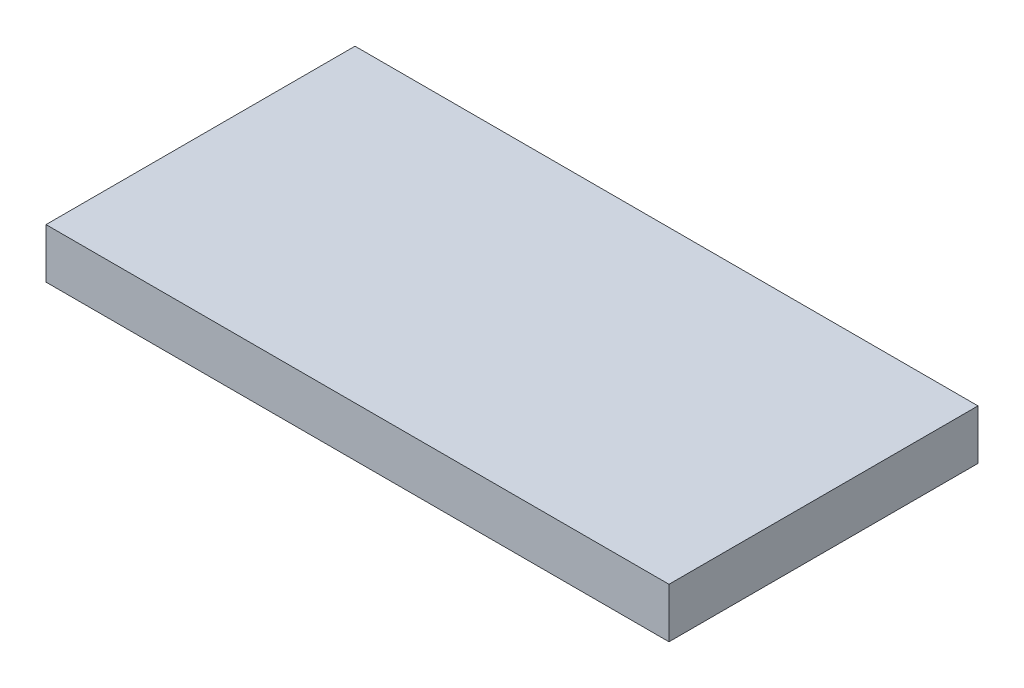
ISO-10303-21;
HEADER;
FILE_DESCRIPTION(('STEP AP214'),'2;1');
FILE_NAME('part.step','',(''),(''),'','','');
FILE_SCHEMA(('AUTOMOTIVE_DESIGN { 1 0 10303 214 1 1 1 1 }'));
ENDSEC;
DATA;
#1=APPLICATION_CONTEXT('core data for automotive mechanical design processes');
#2=APPLICATION_PROTOCOL_DEFINITION('international standard','automotive_design',2000,#1);
#3=PRODUCT_CONTEXT('',#1,'mechanical');
#4=PRODUCT('Part','Part','',(#3));
#5=PRODUCT_RELATED_PRODUCT_CATEGORY('part','',(#4));
#6=PRODUCT_DEFINITION_FORMATION('','',#4);
#7=PRODUCT_DEFINITION_CONTEXT('part definition',#1,'design');
#8=PRODUCT_DEFINITION('design','',#6,#7);
#9=PRODUCT_DEFINITION_SHAPE('','',#8);
#10=(LENGTH_UNIT() NAMED_UNIT(*) SI_UNIT(.MILLI.,.METRE.));
#11=(NAMED_UNIT(*) PLANE_ANGLE_UNIT() SI_UNIT($,.RADIAN.));
#12=(NAMED_UNIT(*) SI_UNIT($,.STERADIAN.) SOLID_ANGLE_UNIT());
#13=UNCERTAINTY_MEASURE_WITH_UNIT(LENGTH_MEASURE(1.E-05),#10,'distance_accuracy_value','');
#14=(GEOMETRIC_REPRESENTATION_CONTEXT(3) GLOBAL_UNCERTAINTY_ASSIGNED_CONTEXT((#13)) GLOBAL_UNIT_ASSIGNED_CONTEXT((#10,
#11,#12)) REPRESENTATION_CONTEXT('',''));
#15=CARTESIAN_POINT('',(0.,0.,0.));
#16=DIRECTION('',(0.,0.,1.));
#17=DIRECTION('',(1.,0.,0.));
#18=AXIS2_PLACEMENT_3D('',#15,#16,#17);
#19=CARTESIAN_POINT('',(-11.3507623511407,38.4864983767566,241.580273248527));
#20=DIRECTION('',(0.,1.,0.));
#21=DIRECTION('',(0.,0.,1.));
#22=AXIS2_PLACEMENT_3D('',#19,#20,#21);
#23=PLANE('',#22);
#24=DIRECTION('',(0.,0.,-1.));
#25=VECTOR('',#24,1.);
#26=CARTESIAN_POINT('',(-12.9382623511407,38.4864983767566,240.792873248526));
#27=LINE('',#26,#25);
#28=CARTESIAN_POINT('',(-12.9382623511407,38.4864983767566,242.367673248527));
#29=VERTEX_POINT('',#28);
#30=CARTESIAN_POINT('',(-12.9382623511407,38.4864983767566,240.792873248526));
#31=VERTEX_POINT('',#30);
#32=EDGE_CURVE('E20',#29,#31,#27,.T.);
#33=ORIENTED_EDGE('',*,*,#32,.T.);
#34=DIRECTION('',(1.,0.,0.));
#35=VECTOR('',#34,1.);
#36=CARTESIAN_POINT('',(-12.9382623511407,38.4864983767566,240.792873248526));
#37=LINE('',#36,#35);
#38=CARTESIAN_POINT('',(-9.76326235114065,38.4864983767566,240.792873248526));
#39=VERTEX_POINT('',#38);
#40=EDGE_CURVE('E88',#31,#39,#37,.T.);
#41=ORIENTED_EDGE('',*,*,#40,.T.);
#42=DIRECTION('',(0.,0.,1.));
#43=VECTOR('',#42,1.);
#44=CARTESIAN_POINT('',(-9.76326235114065,38.4864983767566,240.792873248526));
#45=LINE('',#44,#43);
#46=CARTESIAN_POINT('',(-9.76326235114065,38.4864983767566,242.367673248527));
#47=VERTEX_POINT('',#46);
#48=EDGE_CURVE('E56',#39,#47,#45,.T.);
#49=ORIENTED_EDGE('',*,*,#48,.T.);
#50=DIRECTION('',(-1.,0.,0.));
#51=VECTOR('',#50,1.);
#52=CARTESIAN_POINT('',(-12.9382623511407,38.4864983767566,242.367673248527));
#53=LINE('',#52,#51);
#54=EDGE_CURVE('E58',#47,#29,#53,.T.);
#55=ORIENTED_EDGE('',*,*,#54,.T.);
#56=EDGE_LOOP('',(#33,#41,#49,#55));
#57=FACE_BOUND('',#56,.T.);
#58=ADVANCED_FACE('F17',(#57),#23,.F.);
#59=CARTESIAN_POINT('',(-12.9382623511407,38.7404983767566,240.792873248526));
#60=DIRECTION('',(1.,0.,0.));
#61=DIRECTION('',(0.,0.,-1.));
#62=AXIS2_PLACEMENT_3D('',#59,#60,#61);
#63=PLANE('',#62);
#64=DIRECTION('',(0.,0.,1.));
#65=VECTOR('',#64,1.);
#66=CARTESIAN_POINT('',(-12.9382623511407,38.7404983767566,241.580273248527));
#67=LINE('',#66,#65);
#68=CARTESIAN_POINT('',(-12.9382623511407,38.7404983767566,240.792873248526));
#69=VERTEX_POINT('',#68);
#70=CARTESIAN_POINT('',(-12.9382623511407,38.7404983767566,242.367673248527));
#71=VERTEX_POINT('',#70);
#72=EDGE_CURVE('E94',#69,#71,#67,.T.);
#73=ORIENTED_EDGE('',*,*,#72,.F.);
#74=DIRECTION('',(0.,1.,0.));
#75=VECTOR('',#74,1.);
#76=CARTESIAN_POINT('',(-12.9382623511407,38.7404983767566,240.792873248526));
#77=LINE('',#76,#75);
#78=EDGE_CURVE('E70',#69,#31,#77,.F.);
#79=ORIENTED_EDGE('',*,*,#78,.T.);
#80=ORIENTED_EDGE('',*,*,#32,.F.);
#81=DIRECTION('',(0.,1.,0.));
#82=VECTOR('',#81,1.);
#83=CARTESIAN_POINT('',(-12.9382623511407,38.7404983767566,242.367673248527));
#84=LINE('',#83,#82);
#85=EDGE_CURVE('E65',#29,#71,#84,.T.);
#86=ORIENTED_EDGE('',*,*,#85,.T.);
#87=EDGE_LOOP('',(#73,#79,#80,#86));
#88=FACE_BOUND('',#87,.T.);
#89=ADVANCED_FACE('F67',(#88),#63,.F.);
#90=CARTESIAN_POINT('',(-12.9382623511407,38.7404983767566,242.367673248527));
#91=DIRECTION('',(0.,0.,-1.));
#92=DIRECTION('',(-1.,0.,0.));
#93=AXIS2_PLACEMENT_3D('',#90,#91,#92);
#94=PLANE('',#93);
#95=DIRECTION('',(1.,0.,0.));
#96=VECTOR('',#95,1.);
#97=CARTESIAN_POINT('',(-11.3507623511407,38.7404983767566,242.367673248527));
#98=LINE('',#97,#96);
#99=CARTESIAN_POINT('',(-9.76326235114065,38.7404983767566,242.367673248527));
#100=VERTEX_POINT('',#99);
#101=EDGE_CURVE('E75',#71,#100,#98,.T.);
#102=ORIENTED_EDGE('',*,*,#101,.F.);
#103=ORIENTED_EDGE('',*,*,#85,.F.);
#104=ORIENTED_EDGE('',*,*,#54,.F.);
#105=DIRECTION('',(0.,1.,0.));
#106=VECTOR('',#105,1.);
#107=CARTESIAN_POINT('',(-9.76326235114065,38.7404983767566,242.367673248527));
#108=LINE('',#107,#106);
#109=EDGE_CURVE('E83',#47,#100,#108,.T.);
#110=ORIENTED_EDGE('',*,*,#109,.T.);
#111=EDGE_LOOP('',(#102,#103,#104,#110));
#112=FACE_BOUND('',#111,.T.);
#113=ADVANCED_FACE('F73',(#112),#94,.F.);
#114=CARTESIAN_POINT('',(-9.76326235114065,38.7404983767566,240.792873248526));
#115=DIRECTION('',(-1.,0.,0.));
#116=DIRECTION('',(0.,0.,1.));
#117=AXIS2_PLACEMENT_3D('',#114,#115,#116);
#118=PLANE('',#117);
#119=DIRECTION('',(0.,0.,1.));
#120=VECTOR('',#119,1.);
#121=CARTESIAN_POINT('',(-9.76326235114065,38.7404983767566,241.580273248527));
#122=LINE('',#121,#120);
#123=CARTESIAN_POINT('',(-9.76326235114065,38.7404983767566,240.792873248526));
#124=VERTEX_POINT('',#123);
#125=EDGE_CURVE('E27',#100,#124,#122,.F.);
#126=ORIENTED_EDGE('',*,*,#125,.F.);
#127=ORIENTED_EDGE('',*,*,#109,.F.);
#128=ORIENTED_EDGE('',*,*,#48,.F.);
#129=DIRECTION('',(0.,1.,0.));
#130=VECTOR('',#129,1.);
#131=CARTESIAN_POINT('',(-9.76326235114065,38.7404983767566,240.792873248526));
#132=LINE('',#131,#130);
#133=EDGE_CURVE('E36',#39,#124,#132,.T.);
#134=ORIENTED_EDGE('',*,*,#133,.T.);
#135=EDGE_LOOP('',(#126,#127,#128,#134));
#136=FACE_BOUND('',#135,.T.);
#137=ADVANCED_FACE('F102',(#136),#118,.F.);
#138=CARTESIAN_POINT('',(-12.9382623511407,38.7404983767566,240.792873248526));
#139=DIRECTION('',(0.,0.,1.));
#140=DIRECTION('',(1.,0.,0.));
#141=AXIS2_PLACEMENT_3D('',#138,#139,#140);
#142=PLANE('',#141);
#143=DIRECTION('',(1.,0.,0.));
#144=VECTOR('',#143,1.);
#145=CARTESIAN_POINT('',(-11.3507623511407,38.7404983767566,240.792873248526));
#146=LINE('',#145,#144);
#147=EDGE_CURVE('E11',#124,#69,#146,.F.);
#148=ORIENTED_EDGE('',*,*,#147,.F.);
#149=ORIENTED_EDGE('',*,*,#133,.F.);
#150=ORIENTED_EDGE('',*,*,#40,.F.);
#151=ORIENTED_EDGE('',*,*,#78,.F.);
#152=EDGE_LOOP('',(#148,#149,#150,#151));
#153=FACE_BOUND('',#152,.T.);
#154=ADVANCED_FACE('F104',(#153),#142,.F.);
#155=CARTESIAN_POINT('',(-11.3507623511407,38.7404983767566,241.580273248527));
#156=DIRECTION('',(0.,1.,0.));
#157=DIRECTION('',(0.,0.,1.));
#158=AXIS2_PLACEMENT_3D('',#155,#156,#157);
#159=PLANE('',#158);
#160=ORIENTED_EDGE('',*,*,#125,.T.);
#161=ORIENTED_EDGE('',*,*,#147,.T.);
#162=ORIENTED_EDGE('',*,*,#72,.T.);
#163=ORIENTED_EDGE('',*,*,#101,.T.);
#164=EDGE_LOOP('',(#160,#161,#162,#163));
#165=FACE_BOUND('',#164,.T.);
#166=ADVANCED_FACE('F101',(#165),#159,.T.);
#167=CLOSED_SHELL('',(#58,#89,#113,#137,#154,#166));
#168=MANIFOLD_SOLID_BREP('B1',#167);
#169=ADVANCED_BREP_SHAPE_REPRESENTATION('',(#18,#168),#14);
#170=SHAPE_DEFINITION_REPRESENTATION(#9,#169);
ENDSEC;
END-ISO-10303-21;
